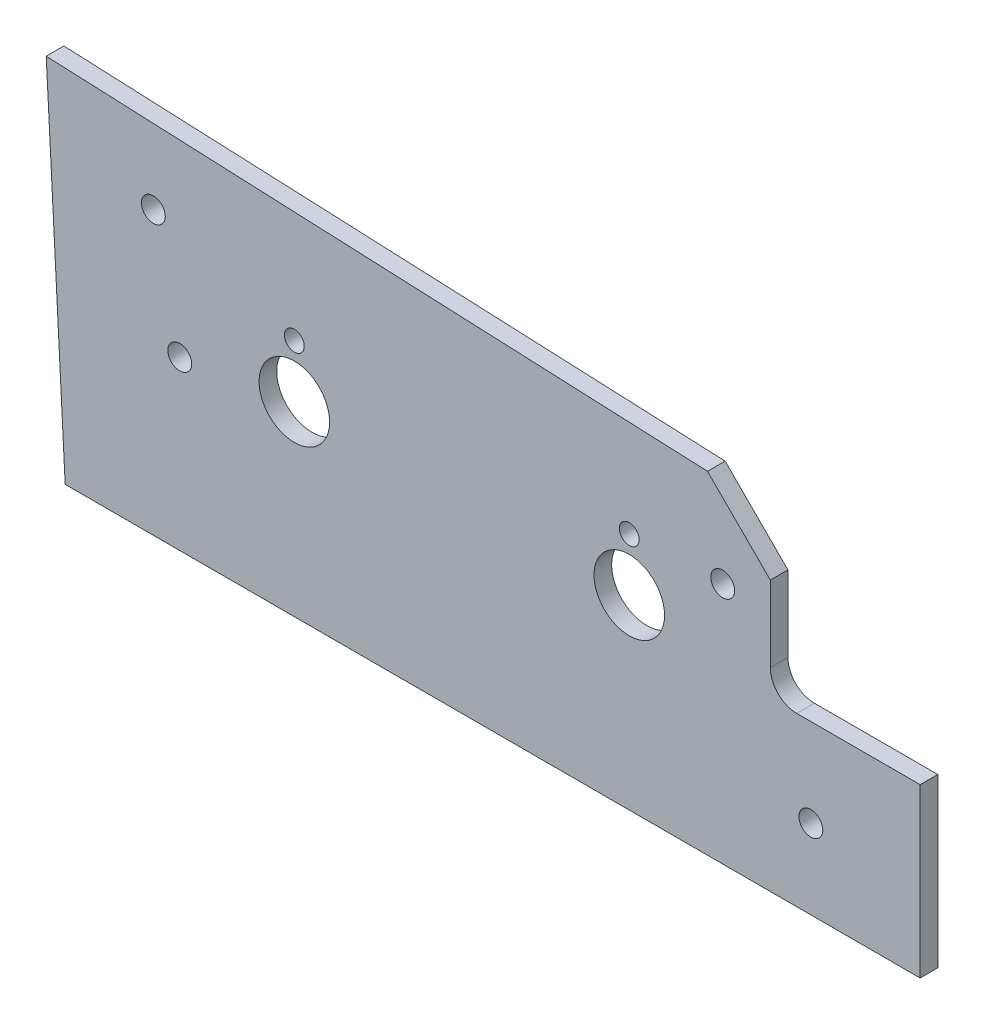
ISO-10303-21;
HEADER;
FILE_DESCRIPTION(('STEP AP214'),'2;1');
FILE_NAME('part.step','',(''),(''),'','','');
FILE_SCHEMA(('AUTOMOTIVE_DESIGN { 1 0 10303 214 1 1 1 1 }'));
ENDSEC;
DATA;
#1=APPLICATION_CONTEXT('core data for automotive mechanical design processes');
#2=APPLICATION_PROTOCOL_DEFINITION('international standard','automotive_design',2000,#1);
#3=PRODUCT_CONTEXT('',#1,'mechanical');
#4=PRODUCT('Part','Part','',(#3));
#5=PRODUCT_RELATED_PRODUCT_CATEGORY('part','',(#4));
#6=PRODUCT_DEFINITION_FORMATION('','',#4);
#7=PRODUCT_DEFINITION_CONTEXT('part definition',#1,'design');
#8=PRODUCT_DEFINITION('design','',#6,#7);
#9=PRODUCT_DEFINITION_SHAPE('','',#8);
#10=(LENGTH_UNIT() NAMED_UNIT(*) SI_UNIT(.MILLI.,.METRE.));
#11=(NAMED_UNIT(*) PLANE_ANGLE_UNIT() SI_UNIT($,.RADIAN.));
#12=(NAMED_UNIT(*) SI_UNIT($,.STERADIAN.) SOLID_ANGLE_UNIT());
#13=UNCERTAINTY_MEASURE_WITH_UNIT(LENGTH_MEASURE(1.E-05),#10,'distance_accuracy_value','');
#14=(GEOMETRIC_REPRESENTATION_CONTEXT(3) GLOBAL_UNCERTAINTY_ASSIGNED_CONTEXT((#13)) GLOBAL_UNIT_ASSIGNED_CONTEXT((#10,
#11,#12)) REPRESENTATION_CONTEXT('',''));
#15=CARTESIAN_POINT('',(0.,0.,0.));
#16=DIRECTION('',(0.,0.,1.));
#17=DIRECTION('',(1.,0.,0.));
#18=AXIS2_PLACEMENT_3D('',#15,#16,#17);
#19=CARTESIAN_POINT('',(-22.225,34.925,-3.175));
#20=DIRECTION('',(0.,0.,1.));
#21=DIRECTION('',(1.,0.,0.));
#22=AXIS2_PLACEMENT_3D('',#19,#20,#21);
#23=CYLINDRICAL_SURFACE('',#22,4.7625);
#24=CARTESIAN_POINT('',(-22.225,34.925,0.));
#25=DIRECTION('',(0.,0.,-1.));
#26=DIRECTION('',(1.,0.,0.));
#27=AXIS2_PLACEMENT_3D('',#24,#25,#26);
#28=CIRCLE('',#27,4.7625);
#29=CARTESIAN_POINT('',(-22.225,30.1625,0.));
#30=VERTEX_POINT('',#29);
#31=CARTESIAN_POINT('',(-26.9875,34.925,0.));
#32=VERTEX_POINT('',#31);
#33=EDGE_CURVE('E129',#30,#32,#28,.T.);
#34=ORIENTED_EDGE('',*,*,#33,.F.);
#35=DIRECTION('',(0.,0.,1.));
#36=VECTOR('',#35,1.);
#37=CARTESIAN_POINT('',(-22.225,30.1625,-3.175));
#38=LINE('',#37,#36);
#39=CARTESIAN_POINT('',(-22.225,30.1625,-3.175));
#40=VERTEX_POINT('',#39);
#41=EDGE_CURVE('E11',#40,#30,#38,.T.);
#42=ORIENTED_EDGE('',*,*,#41,.F.);
#43=CARTESIAN_POINT('',(-22.225,34.925,-3.175));
#44=DIRECTION('',(0.,0.,-1.));
#45=DIRECTION('',(1.,0.,0.));
#46=AXIS2_PLACEMENT_3D('',#43,#44,#45);
#47=CIRCLE('',#46,4.7625);
#48=CARTESIAN_POINT('',(-26.9875,34.925,-3.175));
#49=VERTEX_POINT('',#48);
#50=EDGE_CURVE('E150',#40,#49,#47,.T.);
#51=ORIENTED_EDGE('',*,*,#50,.T.);
#52=DIRECTION('',(0.,0.,1.));
#53=VECTOR('',#52,1.);
#54=CARTESIAN_POINT('',(-26.9875,34.925,-3.175));
#55=LINE('',#54,#53);
#56=EDGE_CURVE('E35',#49,#32,#55,.T.);
#57=ORIENTED_EDGE('',*,*,#56,.T.);
#58=EDGE_LOOP('',(#34,#42,#51,#57));
#59=FACE_BOUND('',#58,.T.);
#60=ADVANCED_FACE('F32',(#59),#23,.F.);
#61=CARTESIAN_POINT('',(0.,30.1625,-3.175));
#62=DIRECTION('',(0.,1.,0.));
#63=DIRECTION('',(0.,0.,1.));
#64=AXIS2_PLACEMENT_3D('',#61,#62,#63);
#65=PLANE('',#64);
#66=DIRECTION('',(-1.,0.,0.));
#67=VECTOR('',#66,1.);
#68=CARTESIAN_POINT('',(0.,30.1625,0.));
#69=LINE('',#68,#67);
#70=CARTESIAN_POINT('',(0.,30.1625,0.));
#71=VERTEX_POINT('',#70);
#72=EDGE_CURVE('E148',#71,#30,#69,.T.);
#73=ORIENTED_EDGE('',*,*,#72,.F.);
#74=DIRECTION('',(0.,0.,1.));
#75=VECTOR('',#74,1.);
#76=CARTESIAN_POINT('',(0.,30.1625,-3.175));
#77=LINE('',#76,#75);
#78=CARTESIAN_POINT('',(0.,30.1625,-3.175));
#79=VERTEX_POINT('',#78);
#80=EDGE_CURVE('E41',#79,#71,#77,.T.);
#81=ORIENTED_EDGE('',*,*,#80,.F.);
#82=DIRECTION('',(-1.,0.,0.));
#83=VECTOR('',#82,1.);
#84=CARTESIAN_POINT('',(0.,30.1625,-3.175));
#85=LINE('',#84,#83);
#86=EDGE_CURVE('E119',#79,#40,#85,.T.);
#87=ORIENTED_EDGE('',*,*,#86,.T.);
#88=ORIENTED_EDGE('',*,*,#41,.T.);
#89=EDGE_LOOP('',(#73,#81,#87,#88));
#90=FACE_BOUND('',#89,.T.);
#91=ADVANCED_FACE('F162',(#90),#65,.T.);
#92=CARTESIAN_POINT('',(0.,0.,-3.175));
#93=DIRECTION('',(1.,0.,0.));
#94=DIRECTION('',(0.,1.,0.));
#95=AXIS2_PLACEMENT_3D('',#92,#93,#94);
#96=PLANE('',#95);
#97=DIRECTION('',(0.,1.,0.));
#98=VECTOR('',#97,1.);
#99=CARTESIAN_POINT('',(0.,0.,0.));
#100=LINE('',#99,#98);
#101=CARTESIAN_POINT('',(0.,0.,0.));
#102=VERTEX_POINT('',#101);
#103=EDGE_CURVE('E106',#102,#71,#100,.T.);
#104=ORIENTED_EDGE('',*,*,#103,.F.);
#105=DIRECTION('',(0.,0.,1.));
#106=VECTOR('',#105,1.);
#107=CARTESIAN_POINT('',(0.,0.,-3.175));
#108=LINE('',#107,#106);
#109=CARTESIAN_POINT('',(0.,0.,-3.175));
#110=VERTEX_POINT('',#109);
#111=EDGE_CURVE('E101',#110,#102,#108,.T.);
#112=ORIENTED_EDGE('',*,*,#111,.F.);
#113=DIRECTION('',(0.,1.,0.));
#114=VECTOR('',#113,1.);
#115=CARTESIAN_POINT('',(0.,0.,-3.175));
#116=LINE('',#115,#114);
#117=EDGE_CURVE('E104',#110,#79,#116,.T.);
#118=ORIENTED_EDGE('',*,*,#117,.T.);
#119=ORIENTED_EDGE('',*,*,#80,.T.);
#120=EDGE_LOOP('',(#104,#112,#118,#119));
#121=FACE_BOUND('',#120,.T.);
#122=ADVANCED_FACE('F103',(#121),#96,.T.);
#123=CARTESIAN_POINT('',(-153.9875,1.07252384123794E-05,-3.175));
#124=DIRECTION('',(-6.96500586890451E-08,-0.999999999999997,0.));
#125=DIRECTION('',(0.999999999999998,-6.96500586890451E-08,0.));
#126=AXIS2_PLACEMENT_3D('',#123,#124,#125);
#127=PLANE('',#126);
#128=DIRECTION('',(0.999999999999998,-6.96500586890451E-08,0.));
#129=VECTOR('',#128,1.);
#130=CARTESIAN_POINT('',(-153.9875,1.07252384123794E-05,0.));
#131=LINE('',#130,#129);
#132=CARTESIAN_POINT('',(-153.9875,1.07252384123794E-05,0.));
#133=VERTEX_POINT('',#132);
#134=EDGE_CURVE('E145',#133,#102,#131,.T.);
#135=ORIENTED_EDGE('',*,*,#134,.F.);
#136=DIRECTION('',(0.,0.,1.));
#137=VECTOR('',#136,1.);
#138=CARTESIAN_POINT('',(-153.9875,1.07252384123794E-05,-3.175));
#139=LINE('',#138,#137);
#140=CARTESIAN_POINT('',(-153.9875,1.07252384123794E-05,-3.175));
#141=VERTEX_POINT('',#140);
#142=EDGE_CURVE('E111',#141,#133,#139,.T.);
#143=ORIENTED_EDGE('',*,*,#142,.F.);
#144=DIRECTION('',(0.999999999999998,-6.96500586890451E-08,0.));
#145=VECTOR('',#144,1.);
#146=CARTESIAN_POINT('',(-153.9875,1.07252384123794E-05,-3.175));
#147=LINE('',#146,#145);
#148=EDGE_CURVE('E117',#141,#110,#147,.T.);
#149=ORIENTED_EDGE('',*,*,#148,.T.);
#150=ORIENTED_EDGE('',*,*,#111,.T.);
#151=EDGE_LOOP('',(#135,#143,#149,#150));
#152=FACE_BOUND('',#151,.T.);
#153=ADVANCED_FACE('F121',(#152),#127,.T.);
#154=CARTESIAN_POINT('',(-157.398586800737,65.087510962821,-3.175));
#155=DIRECTION('',(-0.998629538399774,-0.0523358866883387,0.));
#156=DIRECTION('',(0.0523358866883387,-0.998629538399774,0.));
#157=AXIS2_PLACEMENT_3D('',#154,#155,#156);
#158=PLANE('',#157);
#159=DIRECTION('',(0.0523358866883387,-0.998629538399774,0.));
#160=VECTOR('',#159,1.);
#161=CARTESIAN_POINT('',(-157.398586800737,65.087510962821,0.));
#162=LINE('',#161,#160);
#163=CARTESIAN_POINT('',(-157.398586800737,65.087510962821,0.));
#164=VERTEX_POINT('',#163);
#165=EDGE_CURVE('E142',#164,#133,#162,.T.);
#166=ORIENTED_EDGE('',*,*,#165,.F.);
#167=DIRECTION('',(0.,0.,1.));
#168=VECTOR('',#167,1.);
#169=CARTESIAN_POINT('',(-157.398586800737,65.087510962821,-3.175));
#170=LINE('',#169,#168);
#171=CARTESIAN_POINT('',(-157.398586800737,65.087510962821,-3.175));
#172=VERTEX_POINT('',#171);
#173=EDGE_CURVE('E154',#172,#164,#170,.T.);
#174=ORIENTED_EDGE('',*,*,#173,.F.);
#175=DIRECTION('',(0.0523358866883387,-0.998629538399774,0.));
#176=VECTOR('',#175,1.);
#177=CARTESIAN_POINT('',(-157.398586800737,65.087510962821,-3.175));
#178=LINE('',#177,#176);
#179=EDGE_CURVE('E122',#172,#141,#178,.T.);
#180=ORIENTED_EDGE('',*,*,#179,.T.);
#181=ORIENTED_EDGE('',*,*,#142,.T.);
#182=EDGE_LOOP('',(#166,#174,#180,#181));
#183=FACE_BOUND('',#182,.T.);
#184=ADVANCED_FACE('F175',(#183),#158,.T.);
#185=CARTESIAN_POINT('',(-38.2974340196943,59.8874340196943,-3.175));
#186=DIRECTION('',(0.0436194569491032,0.999048218543762,0.));
#187=DIRECTION('',(-0.999048218543763,0.0436194569491032,0.));
#188=AXIS2_PLACEMENT_3D('',#185,#186,#187);
#189=PLANE('',#188);
#190=DIRECTION('',(-0.999048218543762,0.0436194569491032,0.));
#191=VECTOR('',#190,1.);
#192=CARTESIAN_POINT('',(-38.2974340196943,59.8874340196943,0.));
#193=LINE('',#192,#191);
#194=CARTESIAN_POINT('',(-38.2974340196943,59.8874340196943,0.));
#195=VERTEX_POINT('',#194);
#196=EDGE_CURVE('E139',#195,#164,#193,.T.);
#197=ORIENTED_EDGE('',*,*,#196,.F.);
#198=DIRECTION('',(0.,0.,1.));
#199=VECTOR('',#198,1.);
#200=CARTESIAN_POINT('',(-38.2974340196943,59.8874340196943,-3.175));
#201=LINE('',#200,#199);
#202=CARTESIAN_POINT('',(-38.2974340196943,59.8874340196943,-3.175));
#203=VERTEX_POINT('',#202);
#204=EDGE_CURVE('E156',#203,#195,#201,.T.);
#205=ORIENTED_EDGE('',*,*,#204,.F.);
#206=DIRECTION('',(-0.999048218543762,0.0436194569491032,0.));
#207=VECTOR('',#206,1.);
#208=CARTESIAN_POINT('',(-38.2974340196943,59.8874340196943,-3.175));
#209=LINE('',#208,#207);
#210=EDGE_CURVE('E124',#203,#172,#209,.T.);
#211=ORIENTED_EDGE('',*,*,#210,.T.);
#212=ORIENTED_EDGE('',*,*,#173,.T.);
#213=EDGE_LOOP('',(#197,#205,#211,#212));
#214=FACE_BOUND('',#213,.T.);
#215=ADVANCED_FACE('F178',(#214),#189,.T.);
#216=CARTESIAN_POINT('',(-26.9875,48.5775,-3.175));
#217=DIRECTION('',(0.707106781186548,0.707106781186547,0.));
#218=DIRECTION('',(-0.707106781186547,0.707106781186548,0.));
#219=AXIS2_PLACEMENT_3D('',#216,#217,#218);
#220=PLANE('',#219);
#221=DIRECTION('',(-0.707106781186547,0.707106781186548,0.));
#222=VECTOR('',#221,1.);
#223=CARTESIAN_POINT('',(-26.9875,48.5775,0.));
#224=LINE('',#223,#222);
#225=CARTESIAN_POINT('',(-26.9875,48.5775,0.));
#226=VERTEX_POINT('',#225);
#227=EDGE_CURVE('E136',#226,#195,#224,.T.);
#228=ORIENTED_EDGE('',*,*,#227,.F.);
#229=DIRECTION('',(0.,0.,1.));
#230=VECTOR('',#229,1.);
#231=CARTESIAN_POINT('',(-26.9875,48.5775,-3.175));
#232=LINE('',#231,#230);
#233=CARTESIAN_POINT('',(-26.9875,48.5775,-3.175));
#234=VERTEX_POINT('',#233);
#235=EDGE_CURVE('E157',#234,#226,#232,.T.);
#236=ORIENTED_EDGE('',*,*,#235,.F.);
#237=DIRECTION('',(-0.707106781186547,0.707106781186548,0.));
#238=VECTOR('',#237,1.);
#239=CARTESIAN_POINT('',(-26.9875,48.5775,-3.175));
#240=LINE('',#239,#238);
#241=EDGE_CURVE('E284',#234,#203,#240,.T.);
#242=ORIENTED_EDGE('',*,*,#241,.T.);
#243=ORIENTED_EDGE('',*,*,#204,.T.);
#244=EDGE_LOOP('',(#228,#236,#242,#243));
#245=FACE_BOUND('',#244,.T.);
#246=ADVANCED_FACE('F182',(#245),#220,.T.);
#247=CARTESIAN_POINT('',(-26.9875,34.925,-3.175));
#248=DIRECTION('',(1.,0.,0.));
#249=DIRECTION('',(0.,0.,-1.));
#250=AXIS2_PLACEMENT_3D('',#247,#248,#249);
#251=PLANE('',#250);
#252=DIRECTION('',(0.,1.,0.));
#253=VECTOR('',#252,1.);
#254=CARTESIAN_POINT('',(-26.9875,34.925,0.));
#255=LINE('',#254,#253);
#256=EDGE_CURVE('E132',#32,#226,#255,.T.);
#257=ORIENTED_EDGE('',*,*,#256,.F.);
#258=ORIENTED_EDGE('',*,*,#56,.F.);
#259=DIRECTION('',(0.,1.,0.));
#260=VECTOR('',#259,1.);
#261=CARTESIAN_POINT('',(-26.9875,34.925,-3.175));
#262=LINE('',#261,#260);
#263=EDGE_CURVE('E282',#49,#234,#262,.T.);
#264=ORIENTED_EDGE('',*,*,#263,.T.);
#265=ORIENTED_EDGE('',*,*,#235,.T.);
#266=EDGE_LOOP('',(#257,#258,#264,#265));
#267=FACE_BOUND('',#266,.T.);
#268=ADVANCED_FACE('F159',(#267),#251,.T.);
#269=CARTESIAN_POINT('',(-22.225,34.925,-3.175));
#270=DIRECTION('',(0.,0.,1.));
#271=DIRECTION('',(1.,0.,0.));
#272=AXIS2_PLACEMENT_3D('',#269,#270,#271);
#273=PLANE('',#272);
#274=CARTESIAN_POINT('',(-138.1125,50.8,-3.175));
#275=DIRECTION('',(0.,0.,1.));
#276=DIRECTION('',(1.,0.,0.));
#277=AXIS2_PLACEMENT_3D('',#274,#275,#276);
#278=CIRCLE('',#277,2.15265000000001);
#279=CARTESIAN_POINT('',(-135.95985,50.8,-3.175));
#280=VERTEX_POINT('',#279);
#281=EDGE_CURVE('E233',#280,#280,#278,.T.);
#282=ORIENTED_EDGE('',*,*,#281,.T.);
#283=EDGE_LOOP('',(#282));
#284=FACE_BOUND('',#283,.T.);
#285=CARTESIAN_POINT('',(-19.685,14.2875,-3.175));
#286=DIRECTION('',(0.,0.,1.));
#287=DIRECTION('',(1.,0.,0.));
#288=AXIS2_PLACEMENT_3D('',#285,#286,#287);
#289=CIRCLE('',#288,2.15265);
#290=CARTESIAN_POINT('',(-17.53235,14.2875,-3.175));
#291=VERTEX_POINT('',#290);
#292=EDGE_CURVE('E243',#291,#291,#289,.T.);
#293=ORIENTED_EDGE('',*,*,#292,.T.);
#294=EDGE_LOOP('',(#293));
#295=FACE_BOUND('',#294,.T.);
#296=CARTESIAN_POINT('',(-133.35,30.1625,-3.175));
#297=DIRECTION('',(0.,0.,1.));
#298=DIRECTION('',(1.,0.,0.));
#299=AXIS2_PLACEMENT_3D('',#296,#297,#298);
#300=CIRCLE('',#299,2.15265000000001);
#301=CARTESIAN_POINT('',(-131.19735,30.1625,-3.175));
#302=VERTEX_POINT('',#301);
#303=EDGE_CURVE('E249',#302,#302,#300,.T.);
#304=ORIENTED_EDGE('',*,*,#303,.T.);
#305=EDGE_LOOP('',(#304));
#306=FACE_BOUND('',#305,.T.);
#307=CARTESIAN_POINT('',(-35.56,43.688,-3.175));
#308=DIRECTION('',(0.,0.,1.));
#309=DIRECTION('',(1.,0.,0.));
#310=AXIS2_PLACEMENT_3D('',#307,#308,#309);
#311=CIRCLE('',#310,2.15265);
#312=CARTESIAN_POINT('',(-33.40735,43.688,-3.175));
#313=VERTEX_POINT('',#312);
#314=EDGE_CURVE('E255',#313,#313,#311,.T.);
#315=ORIENTED_EDGE('',*,*,#314,.T.);
#316=EDGE_LOOP('',(#315));
#317=FACE_BOUND('',#316,.T.);
#318=CARTESIAN_POINT('',(-112.7125,43.053,-3.175));
#319=DIRECTION('',(0.,0.,1.));
#320=DIRECTION('',(1.,0.,0.));
#321=AXIS2_PLACEMENT_3D('',#318,#319,#320);
#322=CIRCLE('',#321,1.786001);
#323=CARTESIAN_POINT('',(-110.926499,43.053,-3.175));
#324=VERTEX_POINT('',#323);
#325=EDGE_CURVE('E261',#324,#324,#322,.T.);
#326=ORIENTED_EDGE('',*,*,#325,.T.);
#327=EDGE_LOOP('',(#326));
#328=FACE_BOUND('',#327,.T.);
#329=CARTESIAN_POINT('',(-52.3875,43.053,-3.175));
#330=DIRECTION('',(0.,0.,1.));
#331=DIRECTION('',(1.,0.,0.));
#332=AXIS2_PLACEMENT_3D('',#329,#330,#331);
#333=CIRCLE('',#332,1.786001);
#334=CARTESIAN_POINT('',(-50.601499,43.053,-3.175));
#335=VERTEX_POINT('',#334);
#336=EDGE_CURVE('E267',#335,#335,#333,.T.);
#337=ORIENTED_EDGE('',*,*,#336,.T.);
#338=EDGE_LOOP('',(#337));
#339=FACE_BOUND('',#338,.T.);
#340=CARTESIAN_POINT('',(-112.7125,33.528,-3.175));
#341=DIRECTION('',(0.,0.,1.));
#342=DIRECTION('',(1.,0.,0.));
#343=AXIS2_PLACEMENT_3D('',#340,#341,#342);
#344=CIRCLE('',#343,6.34999999999999);
#345=CARTESIAN_POINT('',(-106.3625,33.528,-3.175));
#346=VERTEX_POINT('',#345);
#347=EDGE_CURVE('E273',#346,#346,#344,.T.);
#348=ORIENTED_EDGE('',*,*,#347,.T.);
#349=EDGE_LOOP('',(#348));
#350=FACE_BOUND('',#349,.T.);
#351=CARTESIAN_POINT('',(-52.3875,33.528,-3.175));
#352=DIRECTION('',(0.,0.,1.));
#353=DIRECTION('',(1.,0.,0.));
#354=AXIS2_PLACEMENT_3D('',#351,#352,#353);
#355=CIRCLE('',#354,6.34999999999999);
#356=CARTESIAN_POINT('',(-46.0375,33.528,-3.175));
#357=VERTEX_POINT('',#356);
#358=EDGE_CURVE('E133',#357,#357,#355,.T.);
#359=ORIENTED_EDGE('',*,*,#358,.T.);
#360=EDGE_LOOP('',(#359));
#361=FACE_BOUND('',#360,.T.);
#362=ORIENTED_EDGE('',*,*,#50,.F.);
#363=ORIENTED_EDGE('',*,*,#86,.F.);
#364=ORIENTED_EDGE('',*,*,#117,.F.);
#365=ORIENTED_EDGE('',*,*,#148,.F.);
#366=ORIENTED_EDGE('',*,*,#179,.F.);
#367=ORIENTED_EDGE('',*,*,#210,.F.);
#368=ORIENTED_EDGE('',*,*,#241,.F.);
#369=ORIENTED_EDGE('',*,*,#263,.F.);
#370=EDGE_LOOP('',(#362,#363,#364,#365,#366,#367,#368,#369));
#371=FACE_BOUND('',#370,.T.);
#372=ADVANCED_FACE('F115',(#284,#295,#306,#317,#328,#339,#350,#361,#371),#273,.F.);
#373=CARTESIAN_POINT('',(-22.225,34.925,0.));
#374=DIRECTION('',(0.,0.,1.));
#375=DIRECTION('',(1.,0.,0.));
#376=AXIS2_PLACEMENT_3D('',#373,#374,#375);
#377=PLANE('',#376);
#378=CARTESIAN_POINT('',(-138.1125,50.8,0.));
#379=DIRECTION('',(0.,0.,1.));
#380=DIRECTION('',(1.,0.,0.));
#381=AXIS2_PLACEMENT_3D('',#378,#379,#380);
#382=CIRCLE('',#381,2.15264999999998);
#383=CARTESIAN_POINT('',(-135.95985,50.8,0.));
#384=VERTEX_POINT('',#383);
#385=EDGE_CURVE('E236',#384,#384,#382,.T.);
#386=ORIENTED_EDGE('',*,*,#385,.F.);
#387=EDGE_LOOP('',(#386));
#388=FACE_BOUND('',#387,.T.);
#389=CARTESIAN_POINT('',(-19.685,14.2875,0.));
#390=DIRECTION('',(0.,0.,1.));
#391=DIRECTION('',(1.,0.,0.));
#392=AXIS2_PLACEMENT_3D('',#389,#390,#391);
#393=CIRCLE('',#392,2.15264999999999);
#394=CARTESIAN_POINT('',(-17.53235,14.2875,0.));
#395=VERTEX_POINT('',#394);
#396=EDGE_CURVE('E238',#395,#395,#393,.T.);
#397=ORIENTED_EDGE('',*,*,#396,.F.);
#398=EDGE_LOOP('',(#397));
#399=FACE_BOUND('',#398,.T.);
#400=CARTESIAN_POINT('',(-133.35,30.1625,0.));
#401=DIRECTION('',(0.,0.,1.));
#402=DIRECTION('',(1.,0.,0.));
#403=AXIS2_PLACEMENT_3D('',#400,#401,#402);
#404=CIRCLE('',#403,2.15265000000001);
#405=CARTESIAN_POINT('',(-131.19735,30.1625,0.));
#406=VERTEX_POINT('',#405);
#407=EDGE_CURVE('E246',#406,#406,#404,.T.);
#408=ORIENTED_EDGE('',*,*,#407,.F.);
#409=EDGE_LOOP('',(#408));
#410=FACE_BOUND('',#409,.T.);
#411=CARTESIAN_POINT('',(-35.56,43.688,0.));
#412=DIRECTION('',(0.,0.,1.));
#413=DIRECTION('',(1.,0.,0.));
#414=AXIS2_PLACEMENT_3D('',#411,#412,#413);
#415=CIRCLE('',#414,2.15265);
#416=CARTESIAN_POINT('',(-33.40735,43.688,0.));
#417=VERTEX_POINT('',#416);
#418=EDGE_CURVE('E252',#417,#417,#415,.T.);
#419=ORIENTED_EDGE('',*,*,#418,.F.);
#420=EDGE_LOOP('',(#419));
#421=FACE_BOUND('',#420,.T.);
#422=CARTESIAN_POINT('',(-112.7125,43.053,0.));
#423=DIRECTION('',(0.,0.,1.));
#424=DIRECTION('',(1.,0.,0.));
#425=AXIS2_PLACEMENT_3D('',#422,#423,#424);
#426=CIRCLE('',#425,1.786001);
#427=CARTESIAN_POINT('',(-110.926499,43.053,0.));
#428=VERTEX_POINT('',#427);
#429=EDGE_CURVE('E258',#428,#428,#426,.T.);
#430=ORIENTED_EDGE('',*,*,#429,.F.);
#431=EDGE_LOOP('',(#430));
#432=FACE_BOUND('',#431,.T.);
#433=CARTESIAN_POINT('',(-52.3875,43.053,0.));
#434=DIRECTION('',(0.,0.,1.));
#435=DIRECTION('',(1.,0.,0.));
#436=AXIS2_PLACEMENT_3D('',#433,#434,#435);
#437=CIRCLE('',#436,1.786001);
#438=CARTESIAN_POINT('',(-50.601499,43.053,0.));
#439=VERTEX_POINT('',#438);
#440=EDGE_CURVE('E264',#439,#439,#437,.T.);
#441=ORIENTED_EDGE('',*,*,#440,.F.);
#442=EDGE_LOOP('',(#441));
#443=FACE_BOUND('',#442,.T.);
#444=CARTESIAN_POINT('',(-112.7125,33.528,0.));
#445=DIRECTION('',(0.,0.,1.));
#446=DIRECTION('',(1.,0.,0.));
#447=AXIS2_PLACEMENT_3D('',#444,#445,#446);
#448=CIRCLE('',#447,6.34999999999999);
#449=CARTESIAN_POINT('',(-106.3625,33.528,0.));
#450=VERTEX_POINT('',#449);
#451=EDGE_CURVE('E270',#450,#450,#448,.T.);
#452=ORIENTED_EDGE('',*,*,#451,.F.);
#453=EDGE_LOOP('',(#452));
#454=FACE_BOUND('',#453,.T.);
#455=CARTESIAN_POINT('',(-52.3875,33.528,0.));
#456=DIRECTION('',(0.,0.,1.));
#457=DIRECTION('',(1.,0.,0.));
#458=AXIS2_PLACEMENT_3D('',#455,#456,#457);
#459=CIRCLE('',#458,6.34999999999999);
#460=CARTESIAN_POINT('',(-46.0375,33.528,0.));
#461=VERTEX_POINT('',#460);
#462=EDGE_CURVE('E276',#461,#461,#459,.T.);
#463=ORIENTED_EDGE('',*,*,#462,.F.);
#464=EDGE_LOOP('',(#463));
#465=FACE_BOUND('',#464,.T.);
#466=ORIENTED_EDGE('',*,*,#33,.T.);
#467=ORIENTED_EDGE('',*,*,#256,.T.);
#468=ORIENTED_EDGE('',*,*,#227,.T.);
#469=ORIENTED_EDGE('',*,*,#196,.T.);
#470=ORIENTED_EDGE('',*,*,#165,.T.);
#471=ORIENTED_EDGE('',*,*,#134,.T.);
#472=ORIENTED_EDGE('',*,*,#103,.T.);
#473=ORIENTED_EDGE('',*,*,#72,.T.);
#474=EDGE_LOOP('',(#466,#467,#468,#469,#470,#471,#472,#473));
#475=FACE_BOUND('',#474,.T.);
#476=ADVANCED_FACE('F161',(#388,#399,#410,#421,#432,#443,#454,#465,#475),#377,.T.);
#477=CARTESIAN_POINT('',(-52.3875,33.528,0.));
#478=DIRECTION('',(0.,0.,1.));
#479=DIRECTION('',(1.,0.,0.));
#480=AXIS2_PLACEMENT_3D('',#477,#478,#479);
#481=CYLINDRICAL_SURFACE('',#480,6.34999999999999);
#482=ORIENTED_EDGE('',*,*,#358,.F.);
#483=EDGE_LOOP('',(#482));
#484=FACE_BOUND('',#483,.T.);
#485=ORIENTED_EDGE('',*,*,#462,.T.);
#486=EDGE_LOOP('',(#485));
#487=FACE_BOUND('',#486,.T.);
#488=ADVANCED_FACE('F194',(#484,#487),#481,.F.);
#489=CARTESIAN_POINT('',(-112.7125,33.528,0.));
#490=DIRECTION('',(0.,0.,1.));
#491=DIRECTION('',(1.,0.,0.));
#492=AXIS2_PLACEMENT_3D('',#489,#490,#491);
#493=CYLINDRICAL_SURFACE('',#492,6.34999999999999);
#494=ORIENTED_EDGE('',*,*,#347,.F.);
#495=EDGE_LOOP('',(#494));
#496=FACE_BOUND('',#495,.T.);
#497=ORIENTED_EDGE('',*,*,#451,.T.);
#498=EDGE_LOOP('',(#497));
#499=FACE_BOUND('',#498,.T.);
#500=ADVANCED_FACE('F201',(#496,#499),#493,.F.);
#501=CARTESIAN_POINT('',(-52.3875,43.053,0.));
#502=DIRECTION('',(0.,0.,1.));
#503=DIRECTION('',(1.,0.,0.));
#504=AXIS2_PLACEMENT_3D('',#501,#502,#503);
#505=CYLINDRICAL_SURFACE('',#504,1.786001);
#506=ORIENTED_EDGE('',*,*,#336,.F.);
#507=EDGE_LOOP('',(#506));
#508=FACE_BOUND('',#507,.T.);
#509=ORIENTED_EDGE('',*,*,#440,.T.);
#510=EDGE_LOOP('',(#509));
#511=FACE_BOUND('',#510,.T.);
#512=ADVANCED_FACE('F205',(#508,#511),#505,.F.);
#513=CARTESIAN_POINT('',(-112.7125,43.053,0.));
#514=DIRECTION('',(0.,0.,1.));
#515=DIRECTION('',(1.,0.,0.));
#516=AXIS2_PLACEMENT_3D('',#513,#514,#515);
#517=CYLINDRICAL_SURFACE('',#516,1.786001);
#518=ORIENTED_EDGE('',*,*,#325,.F.);
#519=EDGE_LOOP('',(#518));
#520=FACE_BOUND('',#519,.T.);
#521=ORIENTED_EDGE('',*,*,#429,.T.);
#522=EDGE_LOOP('',(#521));
#523=FACE_BOUND('',#522,.T.);
#524=ADVANCED_FACE('F209',(#520,#523),#517,.F.);
#525=CARTESIAN_POINT('',(-35.56,43.688,0.));
#526=DIRECTION('',(0.,0.,1.));
#527=DIRECTION('',(1.,0.,0.));
#528=AXIS2_PLACEMENT_3D('',#525,#526,#527);
#529=CYLINDRICAL_SURFACE('',#528,2.15265);
#530=ORIENTED_EDGE('',*,*,#314,.F.);
#531=EDGE_LOOP('',(#530));
#532=FACE_BOUND('',#531,.T.);
#533=ORIENTED_EDGE('',*,*,#418,.T.);
#534=EDGE_LOOP('',(#533));
#535=FACE_BOUND('',#534,.T.);
#536=ADVANCED_FACE('F213',(#532,#535),#529,.F.);
#537=CARTESIAN_POINT('',(-133.35,30.1625,0.));
#538=DIRECTION('',(0.,0.,1.));
#539=DIRECTION('',(1.,0.,0.));
#540=AXIS2_PLACEMENT_3D('',#537,#538,#539);
#541=CYLINDRICAL_SURFACE('',#540,2.15265000000001);
#542=ORIENTED_EDGE('',*,*,#303,.F.);
#543=EDGE_LOOP('',(#542));
#544=FACE_BOUND('',#543,.T.);
#545=ORIENTED_EDGE('',*,*,#407,.T.);
#546=EDGE_LOOP('',(#545));
#547=FACE_BOUND('',#546,.T.);
#548=ADVANCED_FACE('F217',(#544,#547),#541,.F.);
#549=CARTESIAN_POINT('',(-19.685,14.2875,0.));
#550=DIRECTION('',(0.,0.,1.));
#551=DIRECTION('',(1.,0.,0.));
#552=AXIS2_PLACEMENT_3D('',#549,#550,#551);
#553=CYLINDRICAL_SURFACE('',#552,2.15264999999999);
#554=ORIENTED_EDGE('',*,*,#292,.F.);
#555=EDGE_LOOP('',(#554));
#556=FACE_BOUND('',#555,.T.);
#557=ORIENTED_EDGE('',*,*,#396,.T.);
#558=EDGE_LOOP('',(#557));
#559=FACE_BOUND('',#558,.T.);
#560=ADVANCED_FACE('F221',(#556,#559),#553,.F.);
#561=CARTESIAN_POINT('',(-138.1125,50.8,0.));
#562=DIRECTION('',(0.,0.,1.));
#563=DIRECTION('',(1.,0.,0.));
#564=AXIS2_PLACEMENT_3D('',#561,#562,#563);
#565=CYLINDRICAL_SURFACE('',#564,2.15264999999999);
#566=ORIENTED_EDGE('',*,*,#281,.F.);
#567=EDGE_LOOP('',(#566));
#568=FACE_BOUND('',#567,.T.);
#569=ORIENTED_EDGE('',*,*,#385,.T.);
#570=EDGE_LOOP('',(#569));
#571=FACE_BOUND('',#570,.T.);
#572=ADVANCED_FACE('F225',(#568,#571),#565,.F.);
#573=CLOSED_SHELL('',(#60,#91,#122,#153,#184,#215,#246,#268,#372,#476,#488,#500,#512,#524,#536,
#548,#560,#572));
#574=MANIFOLD_SOLID_BREP('B2',#573);
#575=ADVANCED_BREP_SHAPE_REPRESENTATION('',(#18,#574),#14);
#576=SHAPE_DEFINITION_REPRESENTATION(#9,#575);
ENDSEC;
END-ISO-10303-21;
